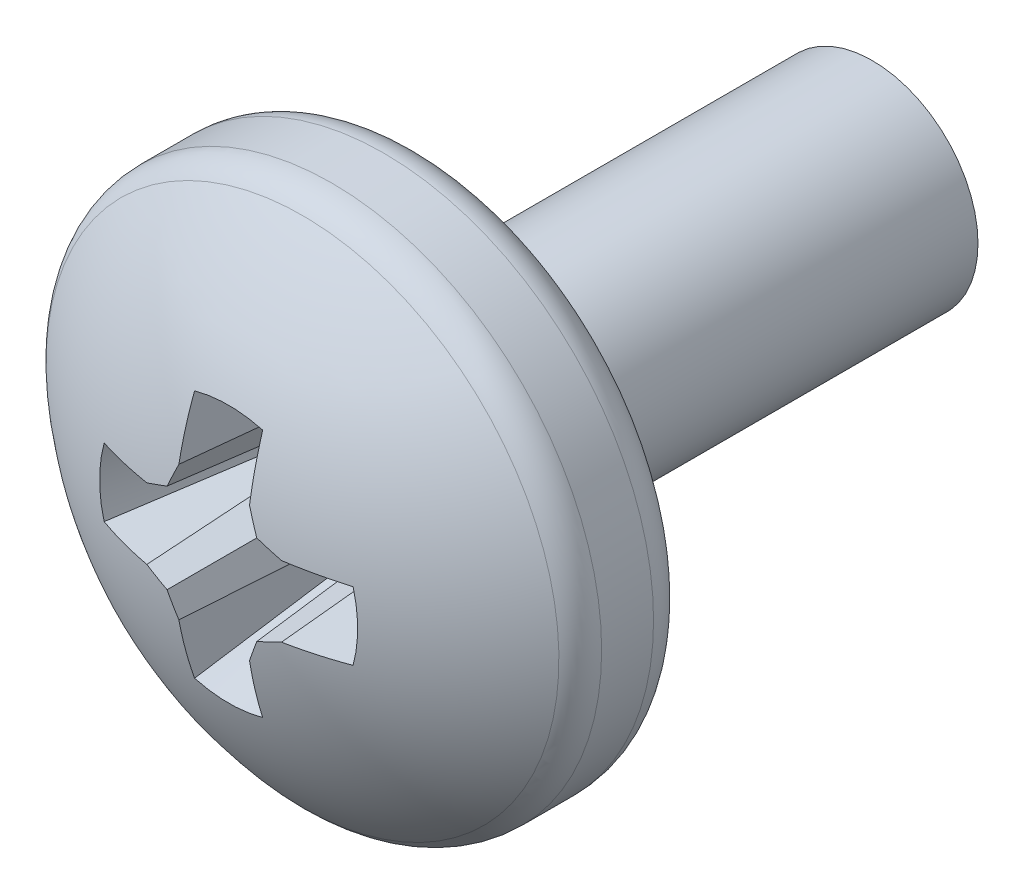
ISO-10303-21;
HEADER;
FILE_DESCRIPTION(('STEP AP214'),'2;1');
FILE_NAME('part.step','',(''),(''),'','','');
FILE_SCHEMA(('AUTOMOTIVE_DESIGN { 1 0 10303 214 1 1 1 1 }'));
ENDSEC;
DATA;
#1=APPLICATION_CONTEXT('core data for automotive mechanical design processes');
#2=APPLICATION_PROTOCOL_DEFINITION('international standard','automotive_design',2000,#1);
#3=PRODUCT_CONTEXT('',#1,'mechanical');
#4=PRODUCT('Part','Part','',(#3));
#5=PRODUCT_RELATED_PRODUCT_CATEGORY('part','',(#4));
#6=PRODUCT_DEFINITION_FORMATION('','',#4);
#7=PRODUCT_DEFINITION_CONTEXT('part definition',#1,'design');
#8=PRODUCT_DEFINITION('design','',#6,#7);
#9=PRODUCT_DEFINITION_SHAPE('','',#8);
#10=(LENGTH_UNIT() NAMED_UNIT(*) SI_UNIT(.MILLI.,.METRE.));
#11=(NAMED_UNIT(*) PLANE_ANGLE_UNIT() SI_UNIT($,.RADIAN.));
#12=(NAMED_UNIT(*) SI_UNIT($,.STERADIAN.) SOLID_ANGLE_UNIT());
#13=UNCERTAINTY_MEASURE_WITH_UNIT(LENGTH_MEASURE(1.E-05),#10,'distance_accuracy_value','');
#14=(GEOMETRIC_REPRESENTATION_CONTEXT(3) GLOBAL_UNCERTAINTY_ASSIGNED_CONTEXT((#13)) GLOBAL_UNIT_ASSIGNED_CONTEXT((#10,
#11,#12)) REPRESENTATION_CONTEXT('',''));
#15=CARTESIAN_POINT('',(0.,0.,0.));
#16=DIRECTION('',(0.,0.,1.));
#17=DIRECTION('',(1.,0.,0.));
#18=AXIS2_PLACEMENT_3D('',#15,#16,#17);
#19=CARTESIAN_POINT('',(0.,0.,5.));
#20=DIRECTION('',(0.,0.,-1.));
#21=DIRECTION('',(-1.,0.,0.));
#22=AXIS2_PLACEMENT_3D('',#19,#20,#21);
#23=PLANE('',#22);
#24=CARTESIAN_POINT('',(0.,0.,5.));
#25=DIRECTION('',(0.,0.,1.));
#26=DIRECTION('',(1.,0.,0.));
#27=AXIS2_PLACEMENT_3D('',#24,#25,#26);
#28=CIRCLE('',#27,1.17524047358084);
#29=CARTESIAN_POINT('',(1.17524047358084,0.,5.));
#30=VERTEX_POINT('',#29);
#31=EDGE_CURVE('E701',#30,#30,#28,.T.);
#32=ORIENTED_EDGE('',*,*,#31,.T.);
#33=EDGE_LOOP('',(#32));
#34=FACE_BOUND('',#33,.T.);
#35=CARTESIAN_POINT('',(0.,0.,4.99999999999996));
#36=DIRECTION('',(0.,0.,1.));
#37=DIRECTION('',(0.,-1.,0.));
#38=AXIS2_PLACEMENT_3D('',#35,#36,#37);
#39=CIRCLE('',#38,2.56799999999996);
#40=CARTESIAN_POINT('',(0.,-2.56799999999992,4.99999999999991));
#41=VERTEX_POINT('',#40);
#42=EDGE_CURVE('E687',#41,#41,#39,.T.);
#43=ORIENTED_EDGE('',*,*,#42,.F.);
#44=EDGE_LOOP('',(#43));
#45=FACE_BOUND('',#44,.T.);
#46=ADVANCED_FACE('F37',(#34,#45),#23,.T.);
#47=CARTESIAN_POINT('',(0.,0.,0.));
#48=DIRECTION('',(0.,0.,1.));
#49=DIRECTION('',(1.,0.,0.));
#50=AXIS2_PLACEMENT_3D('',#47,#48,#49);
#51=PLANE('',#50);
#52=CARTESIAN_POINT('',(0.,0.,0.));
#53=DIRECTION('',(0.,0.,1.));
#54=DIRECTION('',(1.,0.,0.));
#55=AXIS2_PLACEMENT_3D('',#52,#53,#54);
#56=CIRCLE('',#55,1.17524047358084);
#57=CARTESIAN_POINT('',(1.17524047358084,0.,0.));
#58=VERTEX_POINT('',#57);
#59=EDGE_CURVE('E387',#58,#58,#56,.T.);
#60=ORIENTED_EDGE('',*,*,#59,.F.);
#61=EDGE_LOOP('',(#60));
#62=FACE_BOUND('',#61,.T.);
#63=ADVANCED_FACE('F223',(#62),#51,.F.);
#64=CARTESIAN_POINT('',(0.,0.,0.));
#65=DIRECTION('',(0.,0.,1.));
#66=DIRECTION('',(1.,0.,0.));
#67=AXIS2_PLACEMENT_3D('',#64,#65,#66);
#68=CYLINDRICAL_SURFACE('',#67,1.17524047358084);
#69=ORIENTED_EDGE('',*,*,#31,.F.);
#70=EDGE_LOOP('',(#69));
#71=FACE_BOUND('',#70,.T.);
#72=ORIENTED_EDGE('',*,*,#59,.T.);
#73=EDGE_LOOP('',(#72));
#74=FACE_BOUND('',#73,.T.);
#75=ADVANCED_FACE('F229',(#71,#74),#68,.T.);
#76=CARTESIAN_POINT('',(0.,0.,5.43199999999996));
#77=DIRECTION('',(0.,0.,1.));
#78=DIRECTION('',(0.,-1.,0.));
#79=AXIS2_PLACEMENT_3D('',#76,#77,#78);
#80=TOROIDAL_SURFACE('',#79,2.56799999999996,0.432000000000001);
#81=ORIENTED_EDGE('',*,*,#42,.T.);
#82=EDGE_LOOP('',(#81));
#83=FACE_BOUND('',#82,.T.);
#84=CARTESIAN_POINT('',(0.,0.,5.43199999999995));
#85=DIRECTION('',(0.,0.,1.));
#86=DIRECTION('',(0.,-1.,0.));
#87=AXIS2_PLACEMENT_3D('',#84,#85,#86);
#88=CIRCLE('',#87,2.99999999999997);
#89=CARTESIAN_POINT('',(0.,-2.99999999999994,5.4319999999999));
#90=VERTEX_POINT('',#89);
#91=EDGE_CURVE('E690',#90,#90,#88,.T.);
#92=ORIENTED_EDGE('',*,*,#91,.F.);
#93=EDGE_LOOP('',(#92));
#94=FACE_BOUND('',#93,.T.);
#95=ADVANCED_FACE('F240',(#83,#94),#80,.T.);
#96=CARTESIAN_POINT('',(0.,0.,0.));
#97=DIRECTION('',(0.,0.,-1.));
#98=DIRECTION('',(-1.,0.,0.));
#99=AXIS2_PLACEMENT_3D('',#96,#97,#98);
#100=CYLINDRICAL_SURFACE('',#99,2.99999999999999);
#101=ORIENTED_EDGE('',*,*,#91,.T.);
#102=EDGE_LOOP('',(#101));
#103=FACE_BOUND('',#102,.T.);
#104=CARTESIAN_POINT('',(0.,0.,6.0090708000992));
#105=DIRECTION('',(0.,0.,1.));
#106=DIRECTION('',(0.,-1.,0.));
#107=AXIS2_PLACEMENT_3D('',#104,#105,#106);
#108=CIRCLE('',#107,2.99999999999997);
#109=CARTESIAN_POINT('',(0.,-2.99999999999996,6.00907080009915));
#110=VERTEX_POINT('',#109);
#111=EDGE_CURVE('E691',#110,#110,#108,.T.);
#112=ORIENTED_EDGE('',*,*,#111,.F.);
#113=EDGE_LOOP('',(#112));
#114=FACE_BOUND('',#113,.T.);
#115=ADVANCED_FACE('F237',(#103,#114),#100,.T.);
#116=CARTESIAN_POINT('',(0.,0.,3.04999999999998));
#117=DIRECTION('',(0.,0.,1.));
#118=DIRECTION('',(0.,1.,0.));
#119=AXIS2_PLACEMENT_3D('',#116,#117,#118);
#120=SPHERICAL_SURFACE('',#119,4.35000000000002);
#121=CARTESIAN_POINT('',(0.,0.,7.15657099153725));
#122=DIRECTION('',(0.,0.,-1.));
#123=DIRECTION('',(-1.,0.,0.));
#124=AXIS2_PLACEMENT_3D('',#121,#122,#123);
#125=CIRCLE('',#124,1.4347733937681);
#126=CARTESIAN_POINT('',(1.38389267657555,-0.378702721386289,7.15657099153725));
#127=VERTEX_POINT('',#126);
#128=CARTESIAN_POINT('',(1.38389267657558,0.378702721386151,7.15657099153725));
#129=VERTEX_POINT('',#128);
#130=EDGE_CURVE('E375',#127,#129,#125,.F.);
#131=ORIENTED_EDGE('',*,*,#130,.F.);
#132=CARTESIAN_POINT('',(0.,-0.0192767641769202,3.04831350166504));
#133=DIRECTION('',(0.,0.996194698091744,0.0871557427476763));
#134=DIRECTION('',(0.,-0.0871557427476763,0.996194698091744));
#135=AXIS2_PLACEMENT_3D('',#132,#133,#134);
#136=CIRCLE('',#135,4.34995696094644);
#137=CARTESIAN_POINT('',(0.748556860809601,-0.392744849354958,7.3170732486612));
#138=VERTEX_POINT('',#137);
#139=EDGE_CURVE('E11',#138,#127,#136,.T.);
#140=ORIENTED_EDGE('',*,*,#139,.F.);
#141=CARTESIAN_POINT('',(0.104814028886567,-0.253043450064936,3.02603753251248));
#142=DIRECTION('',(-0.38122720636964,0.920363891963228,0.0871557427476818));
#143=DIRECTION('',(-0.923879532511292,-0.382683432365077,0.));
#144=AXIS2_PLACEMENT_3D('',#141,#142,#143);
#145=CIRCLE('',#144,4.34130266531601);
#146=CARTESIAN_POINT('',(0.498659419790987,-0.498659419790991,7.34245588982665));
#147=VERTEX_POINT('',#146);
#148=EDGE_CURVE('E47',#147,#138,#145,.T.);
#149=ORIENTED_EDGE('',*,*,#148,.F.);
#150=CARTESIAN_POINT('',(0.25304345006493,-0.104814028886582,3.02603753251248));
#151=DIRECTION('',(-0.920363891963224,0.381227206369649,0.0871557427476818));
#152=DIRECTION('',(-0.382683432365086,-0.923879532511288,0.));
#153=AXIS2_PLACEMENT_3D('',#150,#151,#152);
#154=CIRCLE('',#153,4.34130266531601);
#155=CARTESIAN_POINT('',(0.392744849354951,-0.748556860809605,7.3170732486612));
#156=VERTEX_POINT('',#155);
#157=EDGE_CURVE('E396',#156,#147,#154,.T.);
#158=ORIENTED_EDGE('',*,*,#157,.F.);
#159=CARTESIAN_POINT('',(0.019276764176918,0.,3.04831350166504));
#160=DIRECTION('',(-0.996194698091744,0.,0.0871557427476763));
#161=DIRECTION('',(0.0871557427476763,0.,0.996194698091744));
#162=AXIS2_PLACEMENT_3D('',#159,#160,#161);
#163=CIRCLE('',#162,4.34995696094644);
#164=CARTESIAN_POINT('',(0.378702721386273,-1.38389267657571,7.1565709915372));
#165=VERTEX_POINT('',#164);
#166=EDGE_CURVE('E355',#165,#156,#163,.T.);
#167=ORIENTED_EDGE('',*,*,#166,.F.);
#168=CARTESIAN_POINT('',(0.,-1.57963138993154E-13,7.15657099153725));
#169=DIRECTION('',(0.,0.,-1.));
#170=DIRECTION('',(0.,1.,0.));
#171=AXIS2_PLACEMENT_3D('',#168,#169,#170);
#172=CIRCLE('',#171,1.4347733937681);
#173=CARTESIAN_POINT('',(-0.378702721386162,-1.38389267657574,7.1565709915372));
#174=VERTEX_POINT('',#173);
#175=EDGE_CURVE('E401',#174,#165,#172,.F.);
#176=ORIENTED_EDGE('',*,*,#175,.F.);
#177=CARTESIAN_POINT('',(-0.0192767641768657,0.,3.04831350166504));
#178=DIRECTION('',(0.996194698091746,0.,0.0871557427476584));
#179=DIRECTION('',(0.0871557427476584,0.,-0.996194698091746));
#180=AXIS2_PLACEMENT_3D('',#177,#178,#179);
#181=CIRCLE('',#180,4.34995696094644);
#182=CARTESIAN_POINT('',(-0.392744849354828,-0.748556860809732,7.31707324866119));
#183=VERTEX_POINT('',#182);
#184=EDGE_CURVE('E335',#183,#174,#181,.T.);
#185=ORIENTED_EDGE('',*,*,#184,.F.);
#186=CARTESIAN_POINT('',(-0.253043450064904,-0.104814028886567,3.02603753251248));
#187=DIRECTION('',(0.920363891963231,0.381227206369636,0.0871557427476721));
#188=DIRECTION('',(-0.382683432365072,0.923879532511294,0.));
#189=AXIS2_PLACEMENT_3D('',#186,#187,#188);
#190=CIRCLE('',#189,4.34130266531601);
#191=CARTESIAN_POINT('',(-0.498659419790861,-0.498659419791117,7.34245588982665));
#192=VERTEX_POINT('',#191);
#193=EDGE_CURVE('E417',#192,#183,#190,.T.);
#194=ORIENTED_EDGE('',*,*,#193,.F.);
#195=CARTESIAN_POINT('',(-0.104814028886582,-0.253043450064961,3.02603753251247));
#196=DIRECTION('',(0.381227206369654,0.920363891963221,0.0871557427476915));
#197=DIRECTION('',(-0.923879532511286,0.382683432365092,0.));
#198=AXIS2_PLACEMENT_3D('',#195,#196,#197);
#199=CIRCLE('',#198,4.34130266531601);
#200=CARTESIAN_POINT('',(-0.748556860809475,-0.39274484935508,7.31707324866121));
#201=VERTEX_POINT('',#200);
#202=EDGE_CURVE('E418',#201,#192,#199,.T.);
#203=ORIENTED_EDGE('',*,*,#202,.F.);
#204=CARTESIAN_POINT('',(0.,-0.0192767641769726,3.04831350166504));
#205=DIRECTION('',(0.,0.996194698091742,0.0871557427476943));
#206=DIRECTION('',(0.,-0.0871557427476943,0.996194698091742));
#207=AXIS2_PLACEMENT_3D('',#204,#205,#206);
#208=CIRCLE('',#207,4.34995696094644);
#209=CARTESIAN_POINT('',(-1.38389267657562,-0.378702721386397,7.15657099153721));
#210=VERTEX_POINT('',#209);
#211=EDGE_CURVE('E313',#210,#201,#208,.T.);
#212=ORIENTED_EDGE('',*,*,#211,.F.);
#213=CARTESIAN_POINT('',(0.,0.,7.15657099153725));
#214=DIRECTION('',(0.,0.,-1.));
#215=DIRECTION('',(-1.,0.,0.));
#216=AXIS2_PLACEMENT_3D('',#213,#214,#215);
#217=CIRCLE('',#216,1.4347733937681);
#218=CARTESIAN_POINT('',(-1.38389267657567,0.378702721386038,7.15657099153723));
#219=VERTEX_POINT('',#218);
#220=EDGE_CURVE('E190',#219,#210,#217,.F.);
#221=ORIENTED_EDGE('',*,*,#220,.F.);
#222=CARTESIAN_POINT('',(0.,0.019276764176811,3.04831350166505));
#223=DIRECTION('',(0.,-0.996194698091747,0.0871557427476404));
#224=DIRECTION('',(0.,-0.0871557427476404,-0.996194698091747));
#225=AXIS2_PLACEMENT_3D('',#222,#223,#224);
#226=CIRCLE('',#225,4.34995696094644);
#227=CARTESIAN_POINT('',(-0.748556860809599,0.3927448493547,7.31707324866122));
#228=VERTEX_POINT('',#227);
#229=EDGE_CURVE('E187',#228,#219,#226,.T.);
#230=ORIENTED_EDGE('',*,*,#229,.F.);
#231=CARTESIAN_POINT('',(-0.104814028886534,0.253043450064841,3.02603753251249));
#232=DIRECTION('',(0.381227206369634,-0.920363891963233,0.0871557427476486));
#233=DIRECTION('',(0.923879532511295,0.38268343236507,0.));
#234=AXIS2_PLACEMENT_3D('',#231,#232,#233);
#235=CIRCLE('',#234,4.34130266531601);
#236=CARTESIAN_POINT('',(-0.498659419790984,0.498659419790731,7.34245588982668));
#237=VERTEX_POINT('',#236);
#238=EDGE_CURVE('E186',#237,#228,#235,.T.);
#239=ORIENTED_EDGE('',*,*,#238,.F.);
#240=CARTESIAN_POINT('',(-0.253043450064898,0.104814028886551,3.02603753251248));
#241=DIRECTION('',(0.920363891963221,-0.381227206369659,0.0871557427476681));
#242=DIRECTION('',(0.382683432365096,0.923879532511284,0.));
#243=AXIS2_PLACEMENT_3D('',#240,#241,#242);
#244=CIRCLE('',#243,4.34130266531601);
#245=CARTESIAN_POINT('',(-0.392744849354947,0.748556860809344,7.31707324866125));
#246=VERTEX_POINT('',#245);
#247=EDGE_CURVE('E41',#246,#237,#244,.T.);
#248=ORIENTED_EDGE('',*,*,#247,.F.);
#249=CARTESIAN_POINT('',(-0.019276764176918,0.,3.04831350166504));
#250=DIRECTION('',(0.996194698091744,0.,0.0871557427476763));
#251=DIRECTION('',(0.0871557427476763,0.,-0.996194698091744));
#252=AXIS2_PLACEMENT_3D('',#249,#250,#251);
#253=CIRCLE('',#252,4.34995696094644);
#254=CARTESIAN_POINT('',(-0.378702721386264,1.38389267657555,7.15657099153725));
#255=VERTEX_POINT('',#254);
#256=EDGE_CURVE('E165',#255,#246,#253,.T.);
#257=ORIENTED_EDGE('',*,*,#256,.F.);
#258=CARTESIAN_POINT('',(0.,0.,7.15657099153725));
#259=DIRECTION('',(0.,0.,-1.));
#260=DIRECTION('',(-1.,0.,0.));
#261=AXIS2_PLACEMENT_3D('',#258,#259,#260);
#262=CIRCLE('',#261,1.4347733937681);
#263=CARTESIAN_POINT('',(0.378702721386153,1.38389267657558,7.15657099153725));
#264=VERTEX_POINT('',#263);
#265=EDGE_CURVE('E174',#264,#255,#262,.F.);
#266=ORIENTED_EDGE('',*,*,#265,.F.);
#267=CARTESIAN_POINT('',(0.0192767641768657,0.,3.04831350166504));
#268=DIRECTION('',(-0.996194698091746,0.,0.0871557427476584));
#269=DIRECTION('',(0.0871557427476584,0.,0.996194698091746));
#270=AXIS2_PLACEMENT_3D('',#267,#268,#269);
#271=CIRCLE('',#270,4.34995696094644);
#272=CARTESIAN_POINT('',(0.392744849354824,0.748556860809471,7.31707324866123));
#273=VERTEX_POINT('',#272);
#274=EDGE_CURVE('E56',#273,#264,#271,.T.);
#275=ORIENTED_EDGE('',*,*,#274,.F.);
#276=CARTESIAN_POINT('',(0.253043450064872,0.104814028886536,3.02603753251249));
#277=DIRECTION('',(-0.920363891963228,-0.381227206369645,0.0871557427476584));
#278=DIRECTION('',(0.382683432365081,-0.92387953251129,0.));
#279=AXIS2_PLACEMENT_3D('',#276,#277,#278);
#280=CIRCLE('',#279,4.34130266531601);
#281=CARTESIAN_POINT('',(0.498659419790858,0.498659419790857,7.34245588982668));
#282=VERTEX_POINT('',#281);
#283=EDGE_CURVE('E714',#282,#273,#280,.T.);
#284=ORIENTED_EDGE('',*,*,#283,.F.);
#285=CARTESIAN_POINT('',(0.104814028886549,0.253043450064867,3.02603753251249));
#286=DIRECTION('',(-0.381227206369648,-0.920363891963227,0.0871557427476584));
#287=DIRECTION('',(0.923879532511289,-0.382683432365084,0.));
#288=AXIS2_PLACEMENT_3D('',#285,#286,#287);
#289=CIRCLE('',#288,4.34130266531601);
#290=CARTESIAN_POINT('',(0.748556860809472,0.392744849354822,7.31707324866123));
#291=VERTEX_POINT('',#290);
#292=EDGE_CURVE('E383',#291,#282,#289,.T.);
#293=ORIENTED_EDGE('',*,*,#292,.F.);
#294=CARTESIAN_POINT('',(0.,0.0192767641768634,3.04831350166504));
#295=DIRECTION('',(0.,-0.996194698091746,0.0871557427476584));
#296=DIRECTION('',(0.,-0.0871557427476584,-0.996194698091746));
#297=AXIS2_PLACEMENT_3D('',#294,#295,#296);
#298=CIRCLE('',#297,4.34995696094644);
#299=EDGE_CURVE('E386',#129,#291,#298,.T.);
#300=ORIENTED_EDGE('',*,*,#299,.F.);
#301=EDGE_LOOP('',(#131,#140,#149,#158,#167,#176,#185,#194,#203,#212,#221,#230,#239,#248,#257,
#266,#275,#284,#293,#300));
#302=FACE_BOUND('',#301,.T.);
#303=CARTESIAN_POINT('',(0.,0.,6.33533894344858));
#304=DIRECTION('',(0.,0.,1.));
#305=DIRECTION('',(0.,-1.,0.));
#306=AXIS2_PLACEMENT_3D('',#303,#304,#305);
#307=CIRCLE('',#306,2.85114854517609);
#308=CARTESIAN_POINT('',(0.,-2.85114854517608,6.33533894344853));
#309=VERTEX_POINT('',#308);
#310=EDGE_CURVE('E694',#309,#309,#307,.T.);
#311=ORIENTED_EDGE('',*,*,#310,.T.);
#312=EDGE_LOOP('',(#311));
#313=FACE_BOUND('',#312,.T.);
#314=ADVANCED_FACE('F183',(#302,#313),#120,.T.);
#315=CARTESIAN_POINT('',(0.,0.,6.00907080009921));
#316=DIRECTION('',(0.,0.,1.));
#317=DIRECTION('',(0.,-1.,0.));
#318=AXIS2_PLACEMENT_3D('',#315,#316,#317);
#319=TOROIDAL_SURFACE('',#318,2.56799999999997,0.431999999999999);
#320=ORIENTED_EDGE('',*,*,#111,.T.);
#321=EDGE_LOOP('',(#320));
#322=FACE_BOUND('',#321,.T.);
#323=ORIENTED_EDGE('',*,*,#310,.F.);
#324=EDGE_LOOP('',(#323));
#325=FACE_BOUND('',#324,.T.);
#326=ADVANCED_FACE('F523',(#322,#325),#319,.T.);
#327=CARTESIAN_POINT('',(0.,0.,7.4));
#328=DIRECTION('',(0.,0.,1.));
#329=DIRECTION('',(1.,0.,0.));
#330=AXIS2_PLACEMENT_3D('',#327,#328,#329);
#331=CONICAL_SURFACE('',#330,1.5,0.26179938779915);
#332=ORIENTED_EDGE('',*,*,#265,.T.);
#333=CARTESIAN_POINT('',(-0.378702721386263,1.38389267657556,7.15657099153724));
#334=CARTESIAN_POINT('',(-0.362651693834498,1.33731799867296,6.97310690710753));
#335=CARTESIAN_POINT('',(-0.346600869574503,1.29073409354626,6.7896451463134));
#336=CARTESIAN_POINT('',(-0.314499858761125,1.19753741171615,6.42272891374505));
#337=CARTESIAN_POINT('',(-0.298449672207706,1.15092463501438,6.23927444197042));
#338=CARTESIAN_POINT('',(-0.266350165479868,1.05765978579468,5.87237540117845));
#339=CARTESIAN_POINT('',(-0.250300845305484,1.0110077132752,5.68893083216151));
#340=CARTESIAN_POINT('',(-0.218203585489805,0.917641049974341,5.32205747369305));
#341=CARTESIAN_POINT('',(-0.202155645848592,0.8709264591893,5.13862868424246));
#342=CARTESIAN_POINT('',(-0.186108654174196,0.824168999859969,4.95521073010217));
#343=B_SPLINE_CURVE_WITH_KNOTS('',3,(#333,#334,#335,#336,#337,#338,#339,#340,#341,#342),
.UNSPECIFIED.,.F.,.F.,(4,2,2,2,4),(0.,0.569888724677614,1.13977741706824,1.70966613189574,
2.27955488007006),.UNSPECIFIED.);
#344=CARTESIAN_POINT('',(-0.221523126407198,0.927290614464391,5.36));
#345=VERTEX_POINT('',#344);
#346=EDGE_CURVE('E171',#345,#255,#343,.F.);
#347=ORIENTED_EDGE('',*,*,#346,.F.);
#348=CARTESIAN_POINT('',(0.,0.,5.36));
#349=DIRECTION('',(0.,0.,1.));
#350=DIRECTION('',(1.,0.,0.));
#351=AXIS2_PLACEMENT_3D('',#348,#349,#350);
#352=CIRCLE('',#351,0.953383647440508);
#353=CARTESIAN_POINT('',(0.221523126407115,0.927290614464411,5.36));
#354=VERTEX_POINT('',#353);
#355=EDGE_CURVE('E422',#354,#345,#352,.T.);
#356=ORIENTED_EDGE('',*,*,#355,.F.);
#357=CARTESIAN_POINT('',(0.470344265964976,1.64970173828366,8.20403863917903));
#358=CARTESIAN_POINT('',(0.449607584624524,1.58957275960076,7.96701728687197));
#359=CARTESIAN_POINT('',(0.428871099254108,1.52943488080175,7.72999817451267));
#360=CARTESIAN_POINT('',(0.387398775765551,1.40912978940431,7.25596734792143));
#361=CARTESIAN_POINT('',(0.366662937647387,1.348962576807,7.01895563368922));
#362=CARTESIAN_POINT('',(0.325192161758327,1.22858727781664,6.54494249624117));
#363=CARTESIAN_POINT('',(0.304457223987457,1.16837919142239,6.30794107302563));
#364=CARTESIAN_POINT('',(0.262988874232051,1.04789385118029,5.83395566641214));
#365=CARTESIAN_POINT('',(0.242255462247576,0.987616597329664,5.59697168301489));
#366=CARTESIAN_POINT('',(0.221523126407115,0.927290614464411,5.36));
#367=B_SPLINE_CURVE_WITH_KNOTS('',3,(#357,#358,#359,#360,#361,#362,#363,#364,#365,#366),
.UNSPECIFIED.,.F.,.F.,(4,2,2,2,4),(0.,0.736221182907864,1.47244233734439,2.20866351355669,
2.9448847195207),.UNSPECIFIED.);
#368=EDGE_CURVE('E696',#354,#264,#367,.F.);
#369=ORIENTED_EDGE('',*,*,#368,.T.);
#370=EDGE_LOOP('',(#332,#347,#356,#369));
#371=FACE_BOUND('',#370,.T.);
#372=ADVANCED_FACE('F252',(#371),#331,.F.);
#373=CARTESIAN_POINT('',(0.4,0.,7.4));
#374=DIRECTION('',(-0.996194698091746,0.,0.0871557427476584));
#375=DIRECTION('',(0.0871557427476584,0.,0.996194698091746));
#376=AXIS2_PLACEMENT_3D('',#373,#374,#375);
#377=PLANE('',#376);
#378=ORIENTED_EDGE('',*,*,#274,.T.);
#379=ORIENTED_EDGE('',*,*,#368,.F.);
#380=DIRECTION('',(0.,-1.,0.));
#381=VECTOR('',#380,1.);
#382=CARTESIAN_POINT('',(0.221523126407115,0.,5.36));
#383=LINE('',#382,#381);
#384=CARTESIAN_POINT('',(0.221523126407115,0.714498742551119,5.36));
#385=VERTEX_POINT('',#384);
#386=EDGE_CURVE('E424',#385,#354,#383,.F.);
#387=ORIENTED_EDGE('',*,*,#386,.F.);
#388=DIRECTION('',(0.0871426484044397,0.0173337504938598,0.996045029063886));
#389=VECTOR('',#388,1.);
#390=CARTESIAN_POINT('',(0.398867118306387,0.749774655820362,7.38705110298917));
#391=LINE('',#390,#389);
#392=EDGE_CURVE('E711',#385,#273,#391,.T.);
#393=ORIENTED_EDGE('',*,*,#392,.T.);
#394=EDGE_LOOP('',(#378,#379,#387,#393));
#395=FACE_BOUND('',#394,.T.);
#396=ADVANCED_FACE('F510',(#395),#377,.T.);
#397=CARTESIAN_POINT('',(0.606586399182262,0.251256313292347,7.4));
#398=DIRECTION('',(-0.920363891963228,-0.381227206369645,0.0871557427476584));
#399=DIRECTION('',(0.382683432365081,-0.92387953251129,0.));
#400=AXIS2_PLACEMENT_3D('',#397,#398,#399);
#401=PLANE('',#400);
#402=ORIENTED_EDGE('',*,*,#283,.T.);
#403=ORIENTED_EDGE('',*,*,#392,.F.);
#404=DIRECTION('',(0.382683432365081,-0.92387953251129,0.));
#405=VECTOR('',#404,1.);
#406=CARTESIAN_POINT('',(0.441695268643191,0.182956170708032,5.36));
#407=LINE('',#406,#405);
#408=CARTESIAN_POINT('',(0.365912341416075,0.365912341416074,5.36));
#409=VERTEX_POINT('',#408);
#410=EDGE_CURVE('E730',#409,#385,#407,.F.);
#411=ORIENTED_EDGE('',*,*,#410,.F.);
#412=DIRECTION('',(0.0666626913468327,0.0666626913468325,0.995546167269401));
#413=VECTOR('',#412,1.);
#414=CARTESIAN_POINT('',(0.501858559970094,0.501858559970092,7.39023211487324));
#415=LINE('',#414,#413);
#416=EDGE_CURVE('E708',#409,#282,#415,.T.);
#417=ORIENTED_EDGE('',*,*,#416,.T.);
#418=EDGE_LOOP('',(#402,#403,#411,#417));
#419=FACE_BOUND('',#418,.T.);
#420=ADVANCED_FACE('F342',(#419),#401,.T.);
#421=CARTESIAN_POINT('',(0.251256313292348,0.606586399182262,7.4));
#422=DIRECTION('',(-0.381227206369648,-0.920363891963227,0.0871557427476584));
#423=DIRECTION('',(0.923879532511289,-0.382683432365084,0.));
#424=AXIS2_PLACEMENT_3D('',#421,#422,#423);
#425=PLANE('',#424);
#426=ORIENTED_EDGE('',*,*,#292,.T.);
#427=ORIENTED_EDGE('',*,*,#416,.F.);
#428=DIRECTION('',(0.923879532511289,-0.382683432365084,0.));
#429=VECTOR('',#428,1.);
#430=CARTESIAN_POINT('',(0.182956170708034,0.44169526864319,5.36));
#431=LINE('',#430,#429);
#432=CARTESIAN_POINT('',(0.71449874255112,0.221523126407113,5.36));
#433=VERTEX_POINT('',#432);
#434=EDGE_CURVE('E380',#433,#409,#431,.F.);
#435=ORIENTED_EDGE('',*,*,#434,.F.);
#436=DIRECTION('',(0.0173337504938599,0.0871426484044397,0.996045029063886));
#437=VECTOR('',#436,1.);
#438=CARTESIAN_POINT('',(0.750162198617137,0.400815427513497,7.4093203791284));
#439=LINE('',#438,#437);
#440=EDGE_CURVE('E705',#433,#291,#439,.T.);
#441=ORIENTED_EDGE('',*,*,#440,.T.);
#442=EDGE_LOOP('',(#426,#427,#435,#441));
#443=FACE_BOUND('',#442,.T.);
#444=ADVANCED_FACE('F496',(#443),#425,.T.);
#445=CARTESIAN_POINT('',(0.,0.399999999999998,7.4));
#446=DIRECTION('',(0.,-0.996194698091746,0.0871557427476584));
#447=DIRECTION('',(0.,-0.0871557427476584,-0.996194698091746));
#448=AXIS2_PLACEMENT_3D('',#445,#446,#447);
#449=PLANE('',#448);
#450=ORIENTED_EDGE('',*,*,#299,.T.);
#451=ORIENTED_EDGE('',*,*,#440,.F.);
#452=DIRECTION('',(1.,0.,0.));
#453=VECTOR('',#452,1.);
#454=CARTESIAN_POINT('',(0.,0.221523126407112,5.36));
#455=LINE('',#454,#453);
#456=CARTESIAN_POINT('',(0.927290614464412,0.221523126407113,5.36));
#457=VERTEX_POINT('',#456);
#458=EDGE_CURVE('E378',#457,#433,#455,.F.);
#459=ORIENTED_EDGE('',*,*,#458,.F.);
#460=CARTESIAN_POINT('',(1.38389267657559,0.378702721386151,7.15657099153725));
#461=CARTESIAN_POINT('',(1.33731799867299,0.362651693834388,6.97310690710753));
#462=CARTESIAN_POINT('',(1.29073409354629,0.346600869574396,6.7896451463134));
#463=CARTESIAN_POINT('',(1.19753741171618,0.314499858761024,6.42272891374505));
#464=CARTESIAN_POINT('',(1.15092463501441,0.298449672207607,6.23927444197042));
#465=CARTESIAN_POINT('',(1.0576597857947,0.266350165479775,5.87237540117846));
#466=CARTESIAN_POINT('',(1.01100771327523,0.250300845305393,5.68893083216151));
#467=CARTESIAN_POINT('',(0.917641049974361,0.21820358548972,5.32205747369305));
#468=CARTESIAN_POINT('',(0.870926459189319,0.20215564584851,5.13862868424246));
#469=CARTESIAN_POINT('',(0.824168999859988,0.186108654174116,4.95521073010217));
#470=B_SPLINE_CURVE_WITH_KNOTS('',3,(#460,#461,#462,#463,#464,#465,#466,#467,#468,#469),
.UNSPECIFIED.,.F.,.F.,(4,2,2,2,4),(0.,0.569888724677615,1.13977741706824,1.70966613189574,
2.27955488007006),.UNSPECIFIED.);
#471=EDGE_CURVE('E257',#457,#129,#470,.F.);
#472=ORIENTED_EDGE('',*,*,#471,.T.);
#473=EDGE_LOOP('',(#450,#451,#459,#472));
#474=FACE_BOUND('',#473,.T.);
#475=ADVANCED_FACE('F250',(#474),#449,.T.);
#476=CARTESIAN_POINT('',(0.,0.,7.4));
#477=DIRECTION('',(0.,0.,1.));
#478=DIRECTION('',(1.,0.,0.));
#479=AXIS2_PLACEMENT_3D('',#476,#477,#478);
#480=CONICAL_SURFACE('',#479,1.5,0.26179938779915);
#481=ORIENTED_EDGE('',*,*,#130,.T.);
#482=ORIENTED_EDGE('',*,*,#471,.F.);
#483=CARTESIAN_POINT('',(0.,0.,5.36));
#484=DIRECTION('',(0.,0.,1.));
#485=DIRECTION('',(1.,0.,0.));
#486=AXIS2_PLACEMENT_3D('',#483,#484,#485);
#487=CIRCLE('',#486,0.953383647440508);
#488=CARTESIAN_POINT('',(0.927290614464387,-0.221523126407216,5.36));
#489=VERTEX_POINT('',#488);
#490=EDGE_CURVE('E273',#489,#457,#487,.T.);
#491=ORIENTED_EDGE('',*,*,#490,.F.);
#492=CARTESIAN_POINT('',(1.64970173828362,-0.470344265965133,8.20403863917903));
#493=CARTESIAN_POINT('',(1.58957275960072,-0.449607584624677,7.96701728687197));
#494=CARTESIAN_POINT('',(1.52943488080171,-0.428871099254255,7.72999817451267));
#495=CARTESIAN_POINT('',(1.40912978940427,-0.38739877576569,7.25596734792143));
#496=CARTESIAN_POINT('',(1.34896257680696,-0.366662937647521,7.01895563368922));
#497=CARTESIAN_POINT('',(1.22858727781661,-0.325192161758451,6.54494249624117));
#498=CARTESIAN_POINT('',(1.16837919142235,-0.304457223987578,6.30794107302563));
#499=CARTESIAN_POINT('',(1.04789385118027,-0.262988874232162,5.83395566641214));
#500=CARTESIAN_POINT('',(0.987616597329638,-0.242255462247682,5.59697168301489));
#501=CARTESIAN_POINT('',(0.927290614464387,-0.221523126407216,5.36));
#502=B_SPLINE_CURVE_WITH_KNOTS('',3,(#492,#493,#494,#495,#496,#497,#498,#499,#500,#501),
.UNSPECIFIED.,.F.,.F.,(4,2,2,2,4),(0.,0.736221182907864,1.47244233734438,2.20866351355669,
2.9448847195207),.UNSPECIFIED.);
#503=EDGE_CURVE('E265',#489,#127,#502,.F.);
#504=ORIENTED_EDGE('',*,*,#503,.T.);
#505=EDGE_LOOP('',(#481,#482,#491,#504));
#506=FACE_BOUND('',#505,.T.);
#507=ADVANCED_FACE('F245',(#506),#480,.F.);
#508=CARTESIAN_POINT('',(0.,0.,5.36));
#509=DIRECTION('',(0.,0.,1.));
#510=DIRECTION('',(1.,0.,0.));
#511=AXIS2_PLACEMENT_3D('',#508,#509,#510);
#512=PLANE('',#511);
#513=DIRECTION('',(-1.,0.,0.));
#514=VECTOR('',#513,1.);
#515=CARTESIAN_POINT('',(0.,-0.221523126407212,5.36));
#516=LINE('',#515,#514);
#517=CARTESIAN_POINT('',(0.714498742551215,-0.221523126407215,5.36));
#518=VERTEX_POINT('',#517);
#519=EDGE_CURVE('E275',#518,#489,#516,.F.);
#520=ORIENTED_EDGE('',*,*,#519,.T.);
#521=ORIENTED_EDGE('',*,*,#490,.T.);
#522=ORIENTED_EDGE('',*,*,#458,.T.);
#523=ORIENTED_EDGE('',*,*,#434,.T.);
#524=ORIENTED_EDGE('',*,*,#410,.T.);
#525=ORIENTED_EDGE('',*,*,#386,.T.);
#526=ORIENTED_EDGE('',*,*,#355,.T.);
#527=DIRECTION('',(0.,1.,0.));
#528=VECTOR('',#527,1.);
#529=CARTESIAN_POINT('',(-0.221523126407209,0.,5.36));
#530=LINE('',#529,#528);
#531=CARTESIAN_POINT('',(-0.221523126407201,0.714498742551025,5.36));
#532=VERTEX_POINT('',#531);
#533=EDGE_CURVE('E435',#345,#532,#530,.F.);
#534=ORIENTED_EDGE('',*,*,#533,.T.);
#535=DIRECTION('',(0.382683432365096,0.923879532511284,0.));
#536=VECTOR('',#535,1.);
#537=CARTESIAN_POINT('',(-0.441695268643237,0.18295617070806,5.36));
#538=LINE('',#537,#536);
#539=CARTESIAN_POINT('',(-0.365912341416167,0.365912341415982,5.36));
#540=VERTEX_POINT('',#539);
#541=EDGE_CURVE('E178',#532,#540,#538,.F.);
#542=ORIENTED_EDGE('',*,*,#541,.T.);
#543=DIRECTION('',(0.923879532511295,0.38268343236507,0.));
#544=VECTOR('',#543,1.);
#545=CARTESIAN_POINT('',(-0.182956170708007,0.441695268643144,5.36));
#546=LINE('',#545,#544);
#547=CARTESIAN_POINT('',(-0.714498742551213,0.221523126407026,5.36));
#548=VERTEX_POINT('',#547);
#549=EDGE_CURVE('E437',#540,#548,#546,.F.);
#550=ORIENTED_EDGE('',*,*,#549,.T.);
#551=DIRECTION('',(1.,0.,0.));
#552=VECTOR('',#551,1.);
#553=CARTESIAN_POINT('',(0.,0.221523126407018,5.36));
#554=LINE('',#553,#552);
#555=CARTESIAN_POINT('',(-0.927290614464403,0.221523126407029,5.36));
#556=VERTEX_POINT('',#555);
#557=EDGE_CURVE('E204',#548,#556,#554,.F.);
#558=ORIENTED_EDGE('',*,*,#557,.T.);
#559=CARTESIAN_POINT('',(0.,-2.66673764292232E-13,5.36));
#560=DIRECTION('',(0.,0.,1.));
#561=DIRECTION('',(1.,0.,0.));
#562=AXIS2_PLACEMENT_3D('',#559,#560,#561);
#563=CIRCLE('',#562,0.953383647440508);
#564=CARTESIAN_POINT('',(-0.927290614464466,-0.2215231264073,5.36));
#565=VERTEX_POINT('',#564);
#566=EDGE_CURVE('E202',#556,#565,#563,.T.);
#567=ORIENTED_EDGE('',*,*,#566,.T.);
#568=DIRECTION('',(-1.,0.,0.));
#569=VECTOR('',#568,1.);
#570=CARTESIAN_POINT('',(0.,-0.221523126407306,5.36));
#571=LINE('',#570,#569);
#572=CARTESIAN_POINT('',(-0.714498742551122,-0.221523126407301,5.36));
#573=VERTEX_POINT('',#572);
#574=EDGE_CURVE('E315',#565,#573,#571,.F.);
#575=ORIENTED_EDGE('',*,*,#574,.T.);
#576=DIRECTION('',(-0.923879532511286,0.382683432365092,0.));
#577=VECTOR('',#576,1.);
#578=CARTESIAN_POINT('',(-0.182956170708106,-0.441695268643355,5.36));
#579=LINE('',#578,#577);
#580=CARTESIAN_POINT('',(-0.365912341416078,-0.365912341416265,5.36));
#581=VERTEX_POINT('',#580);
#582=EDGE_CURVE('E318',#573,#581,#579,.F.);
#583=ORIENTED_EDGE('',*,*,#582,.T.);
#584=DIRECTION('',(-0.382683432365072,0.923879532511294,0.));
#585=VECTOR('',#584,1.);
#586=CARTESIAN_POINT('',(-0.441695268643261,-0.182956170708057,5.36));
#587=LINE('',#586,#585);
#588=CARTESIAN_POINT('',(-0.221523126407122,-0.714498742551311,5.36));
#589=VERTEX_POINT('',#588);
#590=EDGE_CURVE('E321',#581,#589,#587,.F.);
#591=ORIENTED_EDGE('',*,*,#590,.T.);
#592=DIRECTION('',(0.,1.,0.));
#593=VECTOR('',#592,1.);
#594=CARTESIAN_POINT('',(-0.221523126407115,0.,5.36));
#595=LINE('',#594,#593);
#596=CARTESIAN_POINT('',(-0.221523126407124,-0.927290614464536,5.36));
#597=VERTEX_POINT('',#596);
#598=EDGE_CURVE('E312',#589,#597,#595,.F.);
#599=ORIENTED_EDGE('',*,*,#598,.T.);
#600=CARTESIAN_POINT('',(0.,-1.43578705600081E-13,5.36));
#601=DIRECTION('',(0.,0.,1.));
#602=DIRECTION('',(1.,0.,0.));
#603=AXIS2_PLACEMENT_3D('',#600,#601,#602);
#604=CIRCLE('',#603,0.953383647440508);
#605=CARTESIAN_POINT('',(0.221523126407208,-0.927290614464549,5.36));
#606=VERTEX_POINT('',#605);
#607=EDGE_CURVE('E333',#597,#606,#604,.T.);
#608=ORIENTED_EDGE('',*,*,#607,.T.);
#609=DIRECTION('',(0.,-1.,0.));
#610=VECTOR('',#609,1.);
#611=CARTESIAN_POINT('',(0.221523126407209,0.,5.36));
#612=LINE('',#611,#610);
#613=CARTESIAN_POINT('',(0.221523126407208,-0.714498742551218,5.36));
#614=VERTEX_POINT('',#613);
#615=EDGE_CURVE('E357',#606,#614,#612,.F.);
#616=ORIENTED_EDGE('',*,*,#615,.T.);
#617=DIRECTION('',(-0.382683432365086,-0.923879532511288,0.));
#618=VECTOR('',#617,1.);
#619=CARTESIAN_POINT('',(0.441695268643307,-0.182956170708084,5.36));
#620=LINE('',#619,#618);
#621=CARTESIAN_POINT('',(0.36591234141617,-0.365912341416173,5.36));
#622=VERTEX_POINT('',#621);
#623=EDGE_CURVE('E360',#614,#622,#620,.F.);
#624=ORIENTED_EDGE('',*,*,#623,.T.);
#625=DIRECTION('',(-0.923879532511292,-0.382683432365077,0.));
#626=VECTOR('',#625,1.);
#627=CARTESIAN_POINT('',(0.182956170708079,-0.441695268643309,5.36));
#628=LINE('',#627,#626);
#629=EDGE_CURVE('E362',#622,#518,#628,.F.);
#630=ORIENTED_EDGE('',*,*,#629,.T.);
#631=EDGE_LOOP('',(#520,#521,#522,#523,#524,#525,#526,#534,#542,#550,#558,#567,#575,#583,#591,
#599,#608,#616,#624,#630));
#632=FACE_BOUND('',#631,.T.);
#633=ADVANCED_FACE('F249',(#632),#512,.T.);
#634=CARTESIAN_POINT('',(1.31940289610579E-13,-0.400000000000133,7.4));
#635=DIRECTION('',(0.,0.996194698091744,0.0871557427476763));
#636=DIRECTION('',(0.,-0.0871557427476763,0.996194698091744));
#637=AXIS2_PLACEMENT_3D('',#634,#635,#636);
#638=PLANE('',#637);
#639=ORIENTED_EDGE('',*,*,#139,.T.);
#640=ORIENTED_EDGE('',*,*,#503,.F.);
#641=ORIENTED_EDGE('',*,*,#519,.F.);
#642=DIRECTION('',(0.0173337504938775,-0.0871426484044577,0.996045029063884));
#643=VECTOR('',#642,1.);
#644=CARTESIAN_POINT('',(0.749774655820493,-0.398867118306523,7.38705110298915));
#645=LINE('',#644,#643);
#646=EDGE_CURVE('E274',#518,#138,#645,.T.);
#647=ORIENTED_EDGE('',*,*,#646,.T.);
#648=EDGE_LOOP('',(#639,#640,#641,#647));
#649=FACE_BOUND('',#648,.T.);
#650=ADVANCED_FACE('F278',(#649),#638,.T.);
#651=CARTESIAN_POINT('',(0.251256313292478,-0.606586399182396,7.39999999999999));
#652=DIRECTION('',(-0.38122720636964,0.920363891963228,0.0871557427476818));
#653=DIRECTION('',(-0.923879532511292,-0.382683432365077,0.));
#654=AXIS2_PLACEMENT_3D('',#651,#652,#653);
#655=PLANE('',#654);
#656=ORIENTED_EDGE('',*,*,#148,.T.);
#657=ORIENTED_EDGE('',*,*,#646,.F.);
#658=ORIENTED_EDGE('',*,*,#629,.F.);
#659=DIRECTION('',(0.0666626913468502,-0.0666626913468508,0.995546167269398));
#660=VECTOR('',#659,1.);
#661=CARTESIAN_POINT('',(0.501858559970224,-0.501858559970228,7.39023211487322));
#662=LINE('',#661,#660);
#663=EDGE_CURVE('E390',#622,#147,#662,.T.);
#664=ORIENTED_EDGE('',*,*,#663,.T.);
#665=EDGE_LOOP('',(#656,#657,#658,#664));
#666=FACE_BOUND('',#665,.T.);
#667=ADVANCED_FACE('F282',(#666),#655,.T.);
#668=CARTESIAN_POINT('',(0.606586399182394,-0.251256313292484,7.39999999999999));
#669=DIRECTION('',(-0.920363891963224,0.381227206369649,0.0871557427476818));
#670=DIRECTION('',(-0.382683432365086,-0.923879532511288,0.));
#671=AXIS2_PLACEMENT_3D('',#668,#669,#670);
#672=PLANE('',#671);
#673=ORIENTED_EDGE('',*,*,#157,.T.);
#674=ORIENTED_EDGE('',*,*,#663,.F.);
#675=ORIENTED_EDGE('',*,*,#623,.F.);
#676=DIRECTION('',(0.0871426484044575,-0.0173337504938782,0.996045029063884));
#677=VECTOR('',#676,1.);
#678=CARTESIAN_POINT('',(0.400815427513627,-0.750162198617272,7.40932037912838));
#679=LINE('',#678,#677);
#680=EDGE_CURVE('E354',#614,#156,#679,.T.);
#681=ORIENTED_EDGE('',*,*,#680,.T.);
#682=EDGE_LOOP('',(#673,#674,#675,#681));
#683=FACE_BOUND('',#682,.T.);
#684=ADVANCED_FACE('F286',(#683),#672,.T.);
#685=CARTESIAN_POINT('',(0.400000000000131,-1.3467113583969E-13,7.4));
#686=DIRECTION('',(-0.996194698091744,0.,0.0871557427476763));
#687=DIRECTION('',(0.0871557427476763,0.,0.996194698091744));
#688=AXIS2_PLACEMENT_3D('',#685,#686,#687);
#689=PLANE('',#688);
#690=ORIENTED_EDGE('',*,*,#166,.T.);
#691=ORIENTED_EDGE('',*,*,#680,.F.);
#692=ORIENTED_EDGE('',*,*,#615,.F.);
#693=CARTESIAN_POINT('',(0.378702721386273,-1.38389267657572,7.15657099153719));
#694=CARTESIAN_POINT('',(0.362651693834507,-1.33731799867312,6.97310690710748));
#695=CARTESIAN_POINT('',(0.346600869574512,-1.29073409354641,6.78964514631335));
#696=CARTESIAN_POINT('',(0.314499858761134,-1.19753741171629,6.422728913745));
#697=CARTESIAN_POINT('',(0.298449672207714,-1.15092463501452,6.23927444197038));
#698=CARTESIAN_POINT('',(0.266350165479876,-1.0576597857948,5.87237540117842));
#699=CARTESIAN_POINT('',(0.250300845305491,-1.01100771327532,5.68893083216147));
#700=CARTESIAN_POINT('',(0.218203585489812,-0.91764104997444,5.32205747369302));
#701=CARTESIAN_POINT('',(0.202155645848598,-0.870926459189392,5.13862868424243));
#702=CARTESIAN_POINT('',(0.186108654174202,-0.824168999860054,4.95521073010214));
#703=B_SPLINE_CURVE_WITH_KNOTS('',3,(#693,#694,#695,#696,#697,#698,#699,#700,#701,#702),
.UNSPECIFIED.,.F.,.F.,(4,2,2,2,4),(0.,0.569888724677614,1.13977741706824,1.70966613189574,
2.27955488007006),.UNSPECIFIED.);
#704=EDGE_CURVE('E346',#606,#165,#703,.F.);
#705=ORIENTED_EDGE('',*,*,#704,.T.);
#706=EDGE_LOOP('',(#690,#691,#692,#705));
#707=FACE_BOUND('',#706,.T.);
#708=ADVANCED_FACE('F284',(#707),#689,.T.);
#709=CARTESIAN_POINT('',(1.33336882146116E-13,-1.43578705600081E-13,7.4));
#710=DIRECTION('',(0.,0.,1.));
#711=DIRECTION('',(0.,-1.,0.));
#712=AXIS2_PLACEMENT_3D('',#709,#710,#711);
#713=CONICAL_SURFACE('',#712,1.5,0.26179938779915);
#714=ORIENTED_EDGE('',*,*,#175,.T.);
#715=ORIENTED_EDGE('',*,*,#704,.F.);
#716=ORIENTED_EDGE('',*,*,#607,.F.);
#717=CARTESIAN_POINT('',(-0.470344265964996,-1.64970173828382,8.20403863917907));
#718=CARTESIAN_POINT('',(-0.449607584624543,-1.5895727596009,7.96701728687201));
#719=CARTESIAN_POINT('',(-0.428871099254126,-1.52943488080189,7.7299981745127));
#720=CARTESIAN_POINT('',(-0.387398775765568,-1.40912978940443,7.25596734792146));
#721=CARTESIAN_POINT('',(-0.366662937647403,-1.34896257680711,7.01895563368925));
#722=CARTESIAN_POINT('',(-0.325192161758341,-1.22858727781674,6.54494249624119));
#723=CARTESIAN_POINT('',(-0.304457223987472,-1.16837919142247,6.30794107302566));
#724=CARTESIAN_POINT('',(-0.262988874232064,-1.04789385118036,5.83395566641216));
#725=CARTESIAN_POINT('',(-0.242255462247588,-0.987616597329723,5.59697168301491));
#726=CARTESIAN_POINT('',(-0.221523126407126,-0.927290614464461,5.36000000000002));
#727=B_SPLINE_CURVE_WITH_KNOTS('',3,(#717,#718,#719,#720,#721,#722,#723,#724,#725,#726),
.UNSPECIFIED.,.F.,.F.,(4,2,2,2,4),(0.,0.736221182907873,1.47244233734441,2.20866351355672,
2.94488471952074),.UNSPECIFIED.);
#728=EDGE_CURVE('E326',#597,#174,#727,.F.);
#729=ORIENTED_EDGE('',*,*,#728,.T.);
#730=EDGE_LOOP('',(#714,#715,#716,#729));
#731=FACE_BOUND('',#730,.T.);
#732=ADVANCED_FACE('F337',(#731),#713,.F.);
#733=CARTESIAN_POINT('',(-0.4,-2.63880579221158E-13,7.4));
#734=DIRECTION('',(0.996194698091746,0.,0.0871557427476584));
#735=DIRECTION('',(0.0871557427476584,0.,-0.996194698091746));
#736=AXIS2_PLACEMENT_3D('',#733,#734,#735);
#737=PLANE('',#736);
#738=ORIENTED_EDGE('',*,*,#184,.T.);
#739=ORIENTED_EDGE('',*,*,#728,.F.);
#740=ORIENTED_EDGE('',*,*,#598,.F.);
#741=DIRECTION('',(-0.0871426484044398,-0.0173337504938951,0.996045029063885));
#742=VECTOR('',#741,1.);
#743=CARTESIAN_POINT('',(-0.398867118306393,-0.749774655820625,7.38705110298914));
#744=LINE('',#743,#742);
#745=EDGE_CURVE('E334',#589,#183,#744,.T.);
#746=ORIENTED_EDGE('',*,*,#745,.T.);
#747=EDGE_LOOP('',(#738,#739,#740,#746));
#748=FACE_BOUND('',#747,.T.);
#749=ADVANCED_FACE('F299',(#748),#737,.T.);
#750=CARTESIAN_POINT('',(-0.606586399182264,-0.251256313292609,7.39999999999999));
#751=DIRECTION('',(0.920363891963231,0.381227206369636,0.0871557427476721));
#752=DIRECTION('',(-0.382683432365072,0.923879532511294,0.));
#753=AXIS2_PLACEMENT_3D('',#750,#751,#752);
#754=PLANE('',#753);
#755=ORIENTED_EDGE('',*,*,#193,.T.);
#756=ORIENTED_EDGE('',*,*,#745,.F.);
#757=ORIENTED_EDGE('',*,*,#590,.F.);
#758=DIRECTION('',(-0.0666626913468331,-0.0666626913468679,0.995546167269398));
#759=VECTOR('',#758,1.);
#760=CARTESIAN_POINT('',(-0.501858559970097,-0.501858559970355,7.39023211487322));
#761=LINE('',#760,#759);
#762=EDGE_CURVE('E405',#581,#192,#761,.T.);
#763=ORIENTED_EDGE('',*,*,#762,.T.);
#764=EDGE_LOOP('',(#755,#756,#757,#763));
#765=FACE_BOUND('',#764,.T.);
#766=ADVANCED_FACE('F449',(#765),#754,.T.);
#767=CARTESIAN_POINT('',(-0.251256313292353,-0.606586399182526,7.39999999999998));
#768=DIRECTION('',(0.381227206369654,0.920363891963221,0.0871557427476915));
#769=DIRECTION('',(-0.923879532511286,0.382683432365092,0.));
#770=AXIS2_PLACEMENT_3D('',#767,#768,#769);
#771=PLANE('',#770);
#772=ORIENTED_EDGE('',*,*,#202,.T.);
#773=ORIENTED_EDGE('',*,*,#762,.F.);
#774=ORIENTED_EDGE('',*,*,#582,.F.);
#775=DIRECTION('',(-0.0173337504938605,-0.0871426484044754,0.996045029063882));
#776=VECTOR('',#775,1.);
#777=CARTESIAN_POINT('',(-0.750162198617139,-0.400815427513758,7.40932037912839));
#778=LINE('',#777,#776);
#779=EDGE_CURVE('E311',#573,#201,#778,.T.);
#780=ORIENTED_EDGE('',*,*,#779,.T.);
#781=EDGE_LOOP('',(#772,#773,#774,#780));
#782=FACE_BOUND('',#781,.T.);
#783=ADVANCED_FACE('F297',(#782),#771,.T.);
#784=CARTESIAN_POINT('',(0.,-0.400000000000264,7.39999999999999));
#785=DIRECTION('',(0.,0.996194698091742,0.0871557427476943));
#786=DIRECTION('',(0.,-0.0871557427476943,0.996194698091742));
#787=AXIS2_PLACEMENT_3D('',#784,#785,#786);
#788=PLANE('',#787);
#789=ORIENTED_EDGE('',*,*,#211,.T.);
#790=ORIENTED_EDGE('',*,*,#779,.F.);
#791=ORIENTED_EDGE('',*,*,#574,.F.);
#792=CARTESIAN_POINT('',(-1.38389267657558,-0.378702721386398,7.15657099153723));
#793=CARTESIAN_POINT('',(-1.33731799867298,-0.362651693834629,6.97310690710751));
#794=CARTESIAN_POINT('',(-1.29073409354627,-0.346600869574631,6.78964514631338));
#795=CARTESIAN_POINT('',(-1.19753741171616,-0.314499858761246,6.42272891374503));
#796=CARTESIAN_POINT('',(-1.15092463501439,-0.298449672207823,6.2392744419704));
#797=CARTESIAN_POINT('',(-1.05765978579468,-0.266350165479979,5.87237540117844));
#798=CARTESIAN_POINT('',(-1.0110077132752,-0.250300845305591,5.6889308321615));
#799=CARTESIAN_POINT('',(-0.917641049974326,-0.218203585489905,5.32205747369304));
#800=CARTESIAN_POINT('',(-0.870926459189282,-0.202155645848689,5.13862868424245));
#801=CARTESIAN_POINT('',(-0.824168999859947,-0.186108654174289,4.95521073010216));
#802=B_SPLINE_CURVE_WITH_KNOTS('',3,(#792,#793,#794,#795,#796,#797,#798,#799,#800,#801),
.UNSPECIFIED.,.F.,.F.,(4,2,2,2,4),(0.,0.569888724677616,1.13977741706824,1.70966613189575,
2.27955488007007),.UNSPECIFIED.);
#803=EDGE_CURVE('E303',#565,#210,#802,.F.);
#804=ORIENTED_EDGE('',*,*,#803,.T.);
#805=EDGE_LOOP('',(#789,#790,#791,#804));
#806=FACE_BOUND('',#805,.T.);
#807=ADVANCED_FACE('F293',(#806),#788,.T.);
#808=CARTESIAN_POINT('',(0.,-2.66673764292232E-13,7.4));
#809=DIRECTION('',(0.,0.,1.));
#810=DIRECTION('',(1.,0.,0.));
#811=AXIS2_PLACEMENT_3D('',#808,#809,#810);
#812=CONICAL_SURFACE('',#811,1.5,0.26179938779915);
#813=ORIENTED_EDGE('',*,*,#220,.T.);
#814=ORIENTED_EDGE('',*,*,#803,.F.);
#815=ORIENTED_EDGE('',*,*,#566,.F.);
#816=CARTESIAN_POINT('',(-1.64970173828364,0.47034426596485,8.20403863917907));
#817=CARTESIAN_POINT('',(-1.58957275960073,0.449607584624402,7.967017286872));
#818=CARTESIAN_POINT('',(-1.52943488080172,0.428871099253989,7.7299981745127));
#819=CARTESIAN_POINT('',(-1.40912978940426,0.387398775765439,7.25596734792146));
#820=CARTESIAN_POINT('',(-1.34896257680695,0.366662937647278,7.01895563368925));
#821=CARTESIAN_POINT('',(-1.22858727781659,0.325192161758225,6.54494249624119));
#822=CARTESIAN_POINT('',(-1.16837919142233,0.304457223987359,6.30794107302565));
#823=CARTESIAN_POINT('',(-1.04789385118023,0.26298887423196,5.83395566641216));
#824=CARTESIAN_POINT('',(-0.987616597329594,0.242255462247488,5.59697168301491));
#825=CARTESIAN_POINT('',(-0.927290614464337,0.22152312640703,5.36000000000002));
#826=B_SPLINE_CURVE_WITH_KNOTS('',3,(#816,#817,#818,#819,#820,#821,#822,#823,#824,#825),
.UNSPECIFIED.,.F.,.F.,(4,2,2,2,4),(0.,0.736221182907869,1.4724423373444,2.20866351355671,
2.94488471952073),.UNSPECIFIED.);
#827=EDGE_CURVE('E193',#556,#219,#826,.F.);
#828=ORIENTED_EDGE('',*,*,#827,.T.);
#829=EDGE_LOOP('',(#813,#814,#815,#828));
#830=FACE_BOUND('',#829,.T.);
#831=ADVANCED_FACE('F206',(#830),#812,.F.);
#832=CARTESIAN_POINT('',(-1.29147104539504E-13,0.399999999999867,7.40000000000001));
#833=DIRECTION('',(0.,-0.996194698091747,0.0871557427476404));
#834=DIRECTION('',(0.,-0.0871557427476404,-0.996194698091747));
#835=AXIS2_PLACEMENT_3D('',#832,#833,#834);
#836=PLANE('',#835);
#837=ORIENTED_EDGE('',*,*,#229,.T.);
#838=ORIENTED_EDGE('',*,*,#827,.F.);
#839=ORIENTED_EDGE('',*,*,#557,.F.);
#840=DIRECTION('',(-0.0173337504938769,0.0871426484044219,0.996045029063887));
#841=VECTOR('',#840,1.);
#842=CARTESIAN_POINT('',(-0.74977465582049,0.398867118306262,7.38705110298916));
#843=LINE('',#842,#841);
#844=EDGE_CURVE('E203',#548,#228,#843,.T.);
#845=ORIENTED_EDGE('',*,*,#844,.T.);
#846=EDGE_LOOP('',(#837,#838,#839,#845));
#847=FACE_BOUND('',#846,.T.);
#848=ADVANCED_FACE('F210',(#847),#836,.T.);
#849=CARTESIAN_POINT('',(-0.251256313292474,0.606586399182131,7.40000000000001));
#850=DIRECTION('',(0.381227206369634,-0.920363891963233,0.0871557427476486));
#851=DIRECTION('',(0.923879532511295,0.38268343236507,0.));
#852=AXIS2_PLACEMENT_3D('',#849,#850,#851);
#853=PLANE('',#852);
#854=ORIENTED_EDGE('',*,*,#238,.T.);
#855=ORIENTED_EDGE('',*,*,#844,.F.);
#856=ORIENTED_EDGE('',*,*,#549,.F.);
#857=DIRECTION('',(-0.0666626913468497,0.0666626913468154,0.995546167269401));
#858=VECTOR('',#857,1.);
#859=CARTESIAN_POINT('',(-0.50185855997022,0.501858559969965,7.39023211487324));
#860=LINE('',#859,#858);
#861=EDGE_CURVE('E180',#540,#237,#860,.T.);
#862=ORIENTED_EDGE('',*,*,#861,.T.);
#863=EDGE_LOOP('',(#854,#855,#856,#862));
#864=FACE_BOUND('',#863,.T.);
#865=ADVANCED_FACE('F39',(#864),#853,.T.);
#866=CARTESIAN_POINT('',(-0.606586399182392,0.251256313292221,7.4));
#867=DIRECTION('',(0.920363891963221,-0.381227206369659,0.0871557427476681));
#868=DIRECTION('',(0.382683432365096,0.923879532511284,0.));
#869=AXIS2_PLACEMENT_3D('',#866,#867,#868);
#870=PLANE('',#869);
#871=ORIENTED_EDGE('',*,*,#247,.T.);
#872=ORIENTED_EDGE('',*,*,#861,.F.);
#873=ORIENTED_EDGE('',*,*,#541,.F.);
#874=DIRECTION('',(-0.0871426484044574,0.017333750493843,0.996045029063884));
#875=VECTOR('',#874,1.);
#876=CARTESIAN_POINT('',(-0.400815427513622,0.750162198617007,7.40932037912841));
#877=LINE('',#876,#875);
#878=EDGE_CURVE('E168',#532,#246,#877,.T.);
#879=ORIENTED_EDGE('',*,*,#878,.T.);
#880=EDGE_LOOP('',(#871,#872,#873,#879));
#881=FACE_BOUND('',#880,.T.);
#882=ADVANCED_FACE('F176',(#881),#870,.T.);
#883=CARTESIAN_POINT('',(-0.400000000000131,-1.29209443381467E-13,7.4));
#884=DIRECTION('',(0.996194698091744,0.,0.0871557427476763));
#885=DIRECTION('',(0.0871557427476763,0.,-0.996194698091744));
#886=AXIS2_PLACEMENT_3D('',#883,#884,#885);
#887=PLANE('',#886);
#888=ORIENTED_EDGE('',*,*,#256,.T.);
#889=ORIENTED_EDGE('',*,*,#878,.F.);
#890=ORIENTED_EDGE('',*,*,#533,.F.);
#891=ORIENTED_EDGE('',*,*,#346,.T.);
#892=EDGE_LOOP('',(#888,#889,#890,#891));
#893=FACE_BOUND('',#892,.T.);
#894=ADVANCED_FACE('F166',(#893),#887,.T.);
#895=CLOSED_SHELL('',(#46,#63,#75,#95,#115,#314,#326,#372,#396,#420,#444,#475,#507,#633,#650,
#667,#684,#708,#732,#749,#766,#783,#807,#831,#848,#865,#882,#894));
#896=MANIFOLD_SOLID_BREP('B2',#895);
#897=ADVANCED_BREP_SHAPE_REPRESENTATION('',(#18,#896),#14);
#898=SHAPE_DEFINITION_REPRESENTATION(#9,#897);
ENDSEC;
END-ISO-10303-21;
